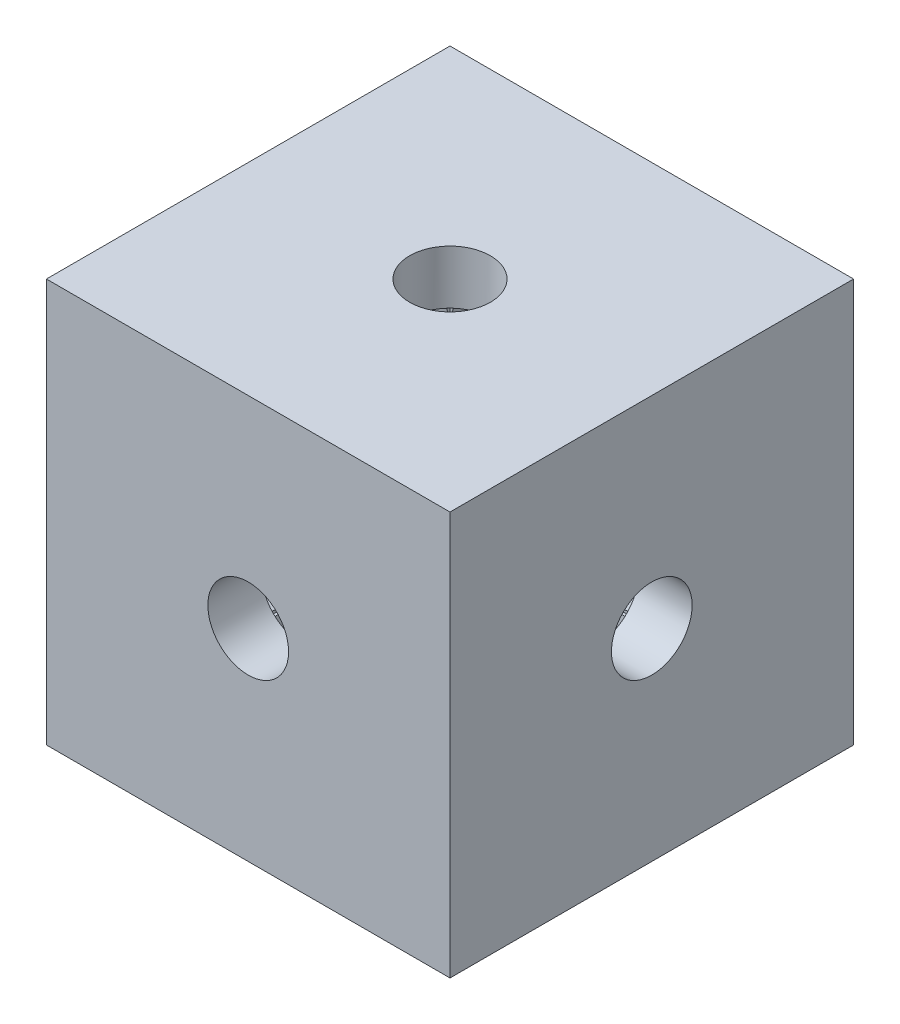
ISO-10303-21;
HEADER;
FILE_DESCRIPTION(('STEP AP214'),'2;1');
FILE_NAME('part.step','',(''),(''),'','','');
FILE_SCHEMA(('AUTOMOTIVE_DESIGN { 1 0 10303 214 1 1 1 1 }'));
ENDSEC;
DATA;
#1=APPLICATION_CONTEXT('core data for automotive mechanical design processes');
#2=APPLICATION_PROTOCOL_DEFINITION('international standard','automotive_design',2000,#1);
#3=PRODUCT_CONTEXT('',#1,'mechanical');
#4=PRODUCT('Part','Part','',(#3));
#5=PRODUCT_RELATED_PRODUCT_CATEGORY('part','',(#4));
#6=PRODUCT_DEFINITION_FORMATION('','',#4);
#7=PRODUCT_DEFINITION_CONTEXT('part definition',#1,'design');
#8=PRODUCT_DEFINITION('design','',#6,#7);
#9=PRODUCT_DEFINITION_SHAPE('','',#8);
#10=(LENGTH_UNIT() NAMED_UNIT(*) SI_UNIT(.MILLI.,.METRE.));
#11=(NAMED_UNIT(*) PLANE_ANGLE_UNIT() SI_UNIT($,.RADIAN.));
#12=(NAMED_UNIT(*) SI_UNIT($,.STERADIAN.) SOLID_ANGLE_UNIT());
#13=UNCERTAINTY_MEASURE_WITH_UNIT(LENGTH_MEASURE(1.E-05),#10,'distance_accuracy_value','');
#14=(GEOMETRIC_REPRESENTATION_CONTEXT(3) GLOBAL_UNCERTAINTY_ASSIGNED_CONTEXT((#13)) GLOBAL_UNIT_ASSIGNED_CONTEXT((#10,
#11,#12)) REPRESENTATION_CONTEXT('',''));
#15=CARTESIAN_POINT('',(0.,0.,0.));
#16=DIRECTION('',(0.,0.,1.));
#17=DIRECTION('',(1.,0.,0.));
#18=AXIS2_PLACEMENT_3D('',#15,#16,#17);
#19=CARTESIAN_POINT('',(7.5,13.,-5.49999999999998));
#20=DIRECTION('',(0.,0.,-1.));
#21=DIRECTION('',(-1.,0.,0.));
#22=AXIS2_PLACEMENT_3D('',#19,#20,#21);
#23=PLANE('',#22);
#24=DIRECTION('',(1.,0.,0.));
#25=VECTOR('',#24,1.);
#26=CARTESIAN_POINT('',(7.5,2.,-5.49999999999998));
#27=LINE('',#26,#25);
#28=CARTESIAN_POINT('',(0.,2.,-5.49999999999998));
#29=VERTEX_POINT('',#28);
#30=CARTESIAN_POINT('',(5.49999999999998,2.,-5.49999999999998));
#31=VERTEX_POINT('',#30);
#32=EDGE_CURVE('E283',#29,#31,#27,.T.);
#33=ORIENTED_EDGE('',*,*,#32,.T.);
#34=DIRECTION('',(0.,1.,0.));
#35=VECTOR('',#34,1.);
#36=CARTESIAN_POINT('',(5.49999999999998,2.,-5.49999999999998));
#37=LINE('',#36,#35);
#38=CARTESIAN_POINT('',(5.5,7.5,-5.49999999999998));
#39=VERTEX_POINT('',#38);
#40=EDGE_CURVE('E292',#31,#39,#37,.T.);
#41=ORIENTED_EDGE('',*,*,#40,.T.);
#42=CARTESIAN_POINT('',(0.,7.5,-5.49999999999998));
#43=DIRECTION('',(0.,0.,-1.));
#44=DIRECTION('',(-1.,0.,0.));
#45=AXIS2_PLACEMENT_3D('',#42,#43,#44);
#46=CIRCLE('',#45,5.5);
#47=EDGE_CURVE('E341',#29,#39,#46,.F.);
#48=ORIENTED_EDGE('',*,*,#47,.F.);
#49=EDGE_LOOP('',(#33,#41,#48));
#50=FACE_BOUND('',#49,.T.);
#51=ADVANCED_FACE('F176',(#50),#23,.F.);
#52=CARTESIAN_POINT('',(0.,2.,0.));
#53=DIRECTION('',(0.,-1.,0.));
#54=DIRECTION('',(0.,0.,-1.));
#55=AXIS2_PLACEMENT_3D('',#52,#53,#54);
#56=PLANE('',#55);
#57=DIRECTION('',(-1.,0.,0.));
#58=VECTOR('',#57,1.);
#59=CARTESIAN_POINT('',(7.5,2.,5.49999999999998));
#60=LINE('',#59,#58);
#61=CARTESIAN_POINT('',(5.49999999999998,2.,5.49999999999998));
#62=VERTEX_POINT('',#61);
#63=CARTESIAN_POINT('',(0.,2.,5.49999999999998));
#64=VERTEX_POINT('',#63);
#65=EDGE_CURVE('E282',#62,#64,#60,.T.);
#66=ORIENTED_EDGE('',*,*,#65,.F.);
#67=DIRECTION('',(0.,0.,-1.));
#68=VECTOR('',#67,1.);
#69=CARTESIAN_POINT('',(5.49999999999998,2.,5.49999999999998));
#70=LINE('',#69,#68);
#71=CARTESIAN_POINT('',(5.49999999999998,2.,0.));
#72=VERTEX_POINT('',#71);
#73=EDGE_CURVE('E293',#62,#72,#70,.T.);
#74=ORIENTED_EDGE('',*,*,#73,.T.);
#75=CARTESIAN_POINT('',(0.,2.,0.));
#76=DIRECTION('',(0.,-1.,0.));
#77=DIRECTION('',(0.,0.,-1.));
#78=AXIS2_PLACEMENT_3D('',#75,#76,#77);
#79=CIRCLE('',#78,5.49999999999998);
#80=EDGE_CURVE('E479',#64,#72,#79,.F.);
#81=ORIENTED_EDGE('',*,*,#80,.F.);
#82=EDGE_LOOP('',(#66,#74,#81));
#83=FACE_BOUND('',#82,.T.);
#84=ADVANCED_FACE('F425',(#83),#56,.F.);
#85=CARTESIAN_POINT('',(-5.49999999999998,13.,7.5));
#86=DIRECTION('',(-1.,0.,0.));
#87=DIRECTION('',(0.,0.,1.));
#88=AXIS2_PLACEMENT_3D('',#85,#86,#87);
#89=PLANE('',#88);
#90=DIRECTION('',(0.,-1.,0.));
#91=VECTOR('',#90,1.);
#92=CARTESIAN_POINT('',(-5.49999999999998,15.,-5.49999999999998));
#93=LINE('',#92,#91);
#94=CARTESIAN_POINT('',(-5.49999999999998,13.,-5.49999999999998));
#95=VERTEX_POINT('',#94);
#96=CARTESIAN_POINT('',(-5.49999999999999,7.5,-5.49999999999999));
#97=VERTEX_POINT('',#96);
#98=EDGE_CURVE('E350',#95,#97,#93,.T.);
#99=ORIENTED_EDGE('',*,*,#98,.F.);
#100=DIRECTION('',(0.,0.,1.));
#101=VECTOR('',#100,1.);
#102=CARTESIAN_POINT('',(-5.49999999999998,13.,-5.49999999999998));
#103=LINE('',#102,#101);
#104=CARTESIAN_POINT('',(-5.49999999999998,13.,0.));
#105=VERTEX_POINT('',#104);
#106=EDGE_CURVE('E300',#95,#105,#103,.T.);
#107=ORIENTED_EDGE('',*,*,#106,.T.);
#108=CARTESIAN_POINT('',(-5.49999999999998,7.5,0.));
#109=DIRECTION('',(-1.,0.,0.));
#110=DIRECTION('',(0.,0.,1.));
#111=AXIS2_PLACEMENT_3D('',#108,#109,#110);
#112=CIRCLE('',#111,5.49999999999998);
#113=EDGE_CURVE('E333',#97,#105,#112,.F.);
#114=ORIENTED_EDGE('',*,*,#113,.F.);
#115=EDGE_LOOP('',(#99,#107,#114));
#116=FACE_BOUND('',#115,.T.);
#117=ADVANCED_FACE('F432',(#116),#89,.F.);
#118=CARTESIAN_POINT('',(0.,13.,-5.49999999999998));
#119=VERTEX_POINT('',#118);
#120=EDGE_CURVE('E288',#39,#119,#46,.F.);
#121=ORIENTED_EDGE('',*,*,#120,.F.);
#122=CARTESIAN_POINT('',(5.49999999999998,13.,-5.49999999999998));
#123=VERTEX_POINT('',#122);
#124=EDGE_CURVE('E286',#39,#123,#37,.T.);
#125=ORIENTED_EDGE('',*,*,#124,.T.);
#126=DIRECTION('',(1.,0.,0.));
#127=VECTOR('',#126,1.);
#128=CARTESIAN_POINT('',(7.5,13.,-5.49999999999998));
#129=LINE('',#128,#127);
#130=EDGE_CURVE('E271',#119,#123,#129,.T.);
#131=ORIENTED_EDGE('',*,*,#130,.F.);
#132=EDGE_LOOP('',(#121,#125,#131));
#133=FACE_BOUND('',#132,.T.);
#134=ADVANCED_FACE('F287',(#133),#23,.F.);
#135=EDGE_CURVE('E352',#72,#29,#79,.F.);
#136=ORIENTED_EDGE('',*,*,#135,.F.);
#137=EDGE_CURVE('E191',#72,#31,#70,.T.);
#138=ORIENTED_EDGE('',*,*,#137,.T.);
#139=ORIENTED_EDGE('',*,*,#32,.F.);
#140=EDGE_LOOP('',(#136,#138,#139));
#141=FACE_BOUND('',#140,.T.);
#142=ADVANCED_FACE('F436',(#141),#56,.F.);
#143=DIRECTION('',(-1.,0.,0.));
#144=VECTOR('',#143,1.);
#145=CARTESIAN_POINT('',(-5.49999999999998,2.,5.49999999999998));
#146=LINE('',#145,#144);
#147=CARTESIAN_POINT('',(-5.49999999999998,2.,5.49999999999998));
#148=VERTEX_POINT('',#147);
#149=EDGE_CURVE('E313',#64,#148,#146,.T.);
#150=ORIENTED_EDGE('',*,*,#149,.F.);
#151=CARTESIAN_POINT('',(-5.49999999999998,2.,0.));
#152=VERTEX_POINT('',#151);
#153=EDGE_CURVE('E351',#152,#64,#79,.F.);
#154=ORIENTED_EDGE('',*,*,#153,.F.);
#155=DIRECTION('',(0.,0.,-1.));
#156=VECTOR('',#155,1.);
#157=CARTESIAN_POINT('',(-5.49999999999998,2.,7.5));
#158=LINE('',#157,#156);
#159=EDGE_CURVE('E376',#148,#152,#158,.T.);
#160=ORIENTED_EDGE('',*,*,#159,.F.);
#161=EDGE_LOOP('',(#150,#154,#160));
#162=FACE_BOUND('',#161,.T.);
#163=ADVANCED_FACE('F435',(#162),#56,.F.);
#164=DIRECTION('',(0.,1.,0.));
#165=VECTOR('',#164,1.);
#166=CARTESIAN_POINT('',(-5.49999999999998,2.,5.49999999999998));
#167=LINE('',#166,#165);
#168=CARTESIAN_POINT('',(-5.49999999999998,7.5,5.49999999999998));
#169=VERTEX_POINT('',#168);
#170=EDGE_CURVE('E317',#148,#169,#167,.T.);
#171=ORIENTED_EDGE('',*,*,#170,.F.);
#172=ORIENTED_EDGE('',*,*,#159,.T.);
#173=EDGE_CURVE('E338',#169,#152,#112,.F.);
#174=ORIENTED_EDGE('',*,*,#173,.F.);
#175=EDGE_LOOP('',(#171,#172,#174));
#176=FACE_BOUND('',#175,.T.);
#177=ADVANCED_FACE('F469',(#176),#89,.F.);
#178=EDGE_CURVE('E337',#105,#169,#112,.F.);
#179=ORIENTED_EDGE('',*,*,#178,.F.);
#180=CARTESIAN_POINT('',(-5.49999999999998,13.,5.49999999999998));
#181=VERTEX_POINT('',#180);
#182=EDGE_CURVE('E297',#105,#181,#103,.T.);
#183=ORIENTED_EDGE('',*,*,#182,.T.);
#184=DIRECTION('',(0.,-1.,0.));
#185=VECTOR('',#184,1.);
#186=CARTESIAN_POINT('',(-5.49999999999998,15.,5.49999999999998));
#187=LINE('',#186,#185);
#188=EDGE_CURVE('E356',#181,#169,#187,.T.);
#189=ORIENTED_EDGE('',*,*,#188,.T.);
#190=EDGE_LOOP('',(#179,#183,#189));
#191=FACE_BOUND('',#190,.T.);
#192=ADVANCED_FACE('F449',(#191),#89,.F.);
#193=DIRECTION('',(0.,0.,1.));
#194=VECTOR('',#193,1.);
#195=CARTESIAN_POINT('',(-5.49999999999998,2.,0.));
#196=LINE('',#195,#194);
#197=CARTESIAN_POINT('',(-5.49999999999998,2.,-5.49999999999998));
#198=VERTEX_POINT('',#197);
#199=EDGE_CURVE('E326',#198,#152,#196,.T.);
#200=ORIENTED_EDGE('',*,*,#199,.T.);
#201=EDGE_CURVE('E347',#29,#152,#79,.F.);
#202=ORIENTED_EDGE('',*,*,#201,.F.);
#203=DIRECTION('',(1.,0.,0.));
#204=VECTOR('',#203,1.);
#205=CARTESIAN_POINT('',(-7.5,2.,-5.49999999999998));
#206=LINE('',#205,#204);
#207=EDGE_CURVE('E370',#198,#29,#206,.T.);
#208=ORIENTED_EDGE('',*,*,#207,.F.);
#209=EDGE_LOOP('',(#200,#202,#208));
#210=FACE_BOUND('',#209,.T.);
#211=ADVANCED_FACE('F442',(#210),#56,.F.);
#212=DIRECTION('',(0.,-1.,0.));
#213=VECTOR('',#212,1.);
#214=CARTESIAN_POINT('',(-5.49999999999998,0.,-5.49999999999998));
#215=LINE('',#214,#213);
#216=EDGE_CURVE('E324',#97,#198,#215,.T.);
#217=ORIENTED_EDGE('',*,*,#216,.T.);
#218=ORIENTED_EDGE('',*,*,#207,.T.);
#219=EDGE_CURVE('E344',#97,#29,#46,.F.);
#220=ORIENTED_EDGE('',*,*,#219,.F.);
#221=EDGE_LOOP('',(#217,#218,#220));
#222=FACE_BOUND('',#221,.T.);
#223=ADVANCED_FACE('F428',(#222),#23,.F.);
#224=EDGE_CURVE('E486',#119,#97,#46,.F.);
#225=ORIENTED_EDGE('',*,*,#224,.F.);
#226=DIRECTION('',(-1.,0.,0.));
#227=VECTOR('',#226,1.);
#228=CARTESIAN_POINT('',(-5.49999999999998,13.,-5.49999999999998));
#229=LINE('',#228,#227);
#230=EDGE_CURVE('E278',#119,#95,#229,.T.);
#231=ORIENTED_EDGE('',*,*,#230,.T.);
#232=ORIENTED_EDGE('',*,*,#98,.T.);
#233=EDGE_LOOP('',(#225,#231,#232));
#234=FACE_BOUND('',#233,.T.);
#235=ADVANCED_FACE('F440',(#234),#23,.F.);
#236=CARTESIAN_POINT('',(0.,0.,0.));
#237=DIRECTION('',(0.,-1.,0.));
#238=DIRECTION('',(0.,0.,-1.));
#239=AXIS2_PLACEMENT_3D('',#236,#237,#238);
#240=PLANE('',#239);
#241=CARTESIAN_POINT('',(0.,0.,0.));
#242=DIRECTION('',(0.,-1.,0.));
#243=DIRECTION('',(0.,0.,-1.));
#244=AXIS2_PLACEMENT_3D('',#241,#242,#243);
#245=CIRCLE('',#244,5.49999999999998);
#246=CARTESIAN_POINT('',(0.,0.,-5.49999999999998));
#247=VERTEX_POINT('',#246);
#248=EDGE_CURVE('E343',#247,#247,#245,.T.);
#249=ORIENTED_EDGE('',*,*,#248,.F.);
#250=EDGE_LOOP('',(#249));
#251=FACE_BOUND('',#250,.T.);
#252=DIRECTION('',(0.,0.,-1.));
#253=VECTOR('',#252,1.);
#254=CARTESIAN_POINT('',(7.5,0.,7.5));
#255=LINE('',#254,#253);
#256=CARTESIAN_POINT('',(7.5,0.,7.5));
#257=VERTEX_POINT('',#256);
#258=CARTESIAN_POINT('',(7.5,0.,-7.5));
#259=VERTEX_POINT('',#258);
#260=EDGE_CURVE('E379',#257,#259,#255,.T.);
#261=ORIENTED_EDGE('',*,*,#260,.F.);
#262=DIRECTION('',(1.,0.,0.));
#263=VECTOR('',#262,1.);
#264=CARTESIAN_POINT('',(-7.5,0.,7.5));
#265=LINE('',#264,#263);
#266=CARTESIAN_POINT('',(-7.5,0.,7.5));
#267=VERTEX_POINT('',#266);
#268=EDGE_CURVE('E386',#267,#257,#265,.T.);
#269=ORIENTED_EDGE('',*,*,#268,.F.);
#270=DIRECTION('',(0.,0.,1.));
#271=VECTOR('',#270,1.);
#272=CARTESIAN_POINT('',(-7.5,0.,7.5));
#273=LINE('',#272,#271);
#274=CARTESIAN_POINT('',(-7.5,0.,-7.5));
#275=VERTEX_POINT('',#274);
#276=EDGE_CURVE('E384',#275,#267,#273,.T.);
#277=ORIENTED_EDGE('',*,*,#276,.F.);
#278=DIRECTION('',(-1.,0.,0.));
#279=VECTOR('',#278,1.);
#280=CARTESIAN_POINT('',(-7.5,0.,-7.5));
#281=LINE('',#280,#279);
#282=EDGE_CURVE('E382',#259,#275,#281,.T.);
#283=ORIENTED_EDGE('',*,*,#282,.F.);
#284=EDGE_LOOP('',(#261,#269,#277,#283));
#285=FACE_BOUND('',#284,.T.);
#286=ADVANCED_FACE('F403',(#251,#285),#240,.T.);
#287=CARTESIAN_POINT('',(7.5,2.,7.5));
#288=DIRECTION('',(-1.,0.,0.));
#289=DIRECTION('',(0.,0.,1.));
#290=AXIS2_PLACEMENT_3D('',#287,#288,#289);
#291=PLANE('',#290);
#292=ORIENTED_EDGE('',*,*,#260,.T.);
#293=DIRECTION('',(0.,-1.,0.));
#294=VECTOR('',#293,1.);
#295=CARTESIAN_POINT('',(7.5,2.,-7.5));
#296=LINE('',#295,#294);
#297=CARTESIAN_POINT('',(7.5,15.,-7.5));
#298=VERTEX_POINT('',#297);
#299=EDGE_CURVE('E12',#298,#259,#296,.T.);
#300=ORIENTED_EDGE('',*,*,#299,.F.);
#301=DIRECTION('',(0.,0.,-1.));
#302=VECTOR('',#301,1.);
#303=CARTESIAN_POINT('',(7.5,15.,-7.5));
#304=LINE('',#303,#302);
#305=CARTESIAN_POINT('',(7.5,15.,7.5));
#306=VERTEX_POINT('',#305);
#307=EDGE_CURVE('E361',#306,#298,#304,.T.);
#308=ORIENTED_EDGE('',*,*,#307,.F.);
#309=DIRECTION('',(0.,-1.,0.));
#310=VECTOR('',#309,1.);
#311=CARTESIAN_POINT('',(7.5,2.,7.5));
#312=LINE('',#311,#310);
#313=EDGE_CURVE('E388',#306,#257,#312,.T.);
#314=ORIENTED_EDGE('',*,*,#313,.T.);
#315=EDGE_LOOP('',(#292,#300,#308,#314));
#316=FACE_BOUND('',#315,.T.);
#317=CARTESIAN_POINT('',(7.5,7.5,0.));
#318=DIRECTION('',(1.,0.,0.));
#319=DIRECTION('',(0.,0.,-1.));
#320=AXIS2_PLACEMENT_3D('',#317,#318,#319);
#321=CIRCLE('',#320,1.5);
#322=CARTESIAN_POINT('',(7.5,7.5,-1.5));
#323=VERTEX_POINT('',#322);
#324=EDGE_CURVE('E968',#323,#323,#321,.T.);
#325=ORIENTED_EDGE('',*,*,#324,.F.);
#326=EDGE_LOOP('',(#325));
#327=FACE_BOUND('',#326,.T.);
#328=ADVANCED_FACE('F178',(#316,#327),#291,.F.);
#329=CARTESIAN_POINT('',(-7.5,2.,-7.5));
#330=DIRECTION('',(0.,0.,1.));
#331=DIRECTION('',(1.,0.,0.));
#332=AXIS2_PLACEMENT_3D('',#329,#330,#331);
#333=PLANE('',#332);
#334=CARTESIAN_POINT('',(0.,7.5,-7.5));
#335=DIRECTION('',(0.,0.,-1.));
#336=DIRECTION('',(-1.,0.,0.));
#337=AXIS2_PLACEMENT_3D('',#334,#335,#336);
#338=CIRCLE('',#337,5.5);
#339=CARTESIAN_POINT('',(-5.5,7.5,-7.5));
#340=VERTEX_POINT('',#339);
#341=EDGE_CURVE('E336',#340,#340,#338,.T.);
#342=ORIENTED_EDGE('',*,*,#341,.F.);
#343=EDGE_LOOP('',(#342));
#344=FACE_BOUND('',#343,.T.);
#345=ORIENTED_EDGE('',*,*,#282,.T.);
#346=DIRECTION('',(0.,-1.,0.));
#347=VECTOR('',#346,1.);
#348=CARTESIAN_POINT('',(-7.5,2.,-7.5));
#349=LINE('',#348,#347);
#350=CARTESIAN_POINT('',(-7.5,15.,-7.5));
#351=VERTEX_POINT('',#350);
#352=EDGE_CURVE('E184',#351,#275,#349,.T.);
#353=ORIENTED_EDGE('',*,*,#352,.F.);
#354=DIRECTION('',(-1.,0.,0.));
#355=VECTOR('',#354,1.);
#356=CARTESIAN_POINT('',(-7.5,15.,-7.5));
#357=LINE('',#356,#355);
#358=EDGE_CURVE('E364',#298,#351,#357,.T.);
#359=ORIENTED_EDGE('',*,*,#358,.F.);
#360=ORIENTED_EDGE('',*,*,#299,.T.);
#361=EDGE_LOOP('',(#345,#353,#359,#360));
#362=FACE_BOUND('',#361,.T.);
#363=ADVANCED_FACE('F414',(#344,#362),#333,.F.);
#364=CARTESIAN_POINT('',(-7.5,2.,7.5));
#365=DIRECTION('',(1.,0.,0.));
#366=DIRECTION('',(0.,0.,-1.));
#367=AXIS2_PLACEMENT_3D('',#364,#365,#366);
#368=PLANE('',#367);
#369=CARTESIAN_POINT('',(-7.5,7.5,0.));
#370=DIRECTION('',(-1.,0.,0.));
#371=DIRECTION('',(0.,0.,1.));
#372=AXIS2_PLACEMENT_3D('',#369,#370,#371);
#373=CIRCLE('',#372,5.49999999999998);
#374=CARTESIAN_POINT('',(-7.5,7.5,5.49999999999998));
#375=VERTEX_POINT('',#374);
#376=EDGE_CURVE('E330',#375,#375,#373,.T.);
#377=ORIENTED_EDGE('',*,*,#376,.F.);
#378=EDGE_LOOP('',(#377));
#379=FACE_BOUND('',#378,.T.);
#380=DIRECTION('',(0.,-1.,0.));
#381=VECTOR('',#380,1.);
#382=CARTESIAN_POINT('',(-7.5,2.,7.5));
#383=LINE('',#382,#381);
#384=CARTESIAN_POINT('',(-7.5,15.,7.5));
#385=VERTEX_POINT('',#384);
#386=EDGE_CURVE('E391',#385,#267,#383,.T.);
#387=ORIENTED_EDGE('',*,*,#386,.F.);
#388=DIRECTION('',(0.,0.,1.));
#389=VECTOR('',#388,1.);
#390=CARTESIAN_POINT('',(-7.5,15.,7.5));
#391=LINE('',#390,#389);
#392=EDGE_CURVE('E367',#351,#385,#391,.T.);
#393=ORIENTED_EDGE('',*,*,#392,.F.);
#394=ORIENTED_EDGE('',*,*,#352,.T.);
#395=ORIENTED_EDGE('',*,*,#276,.T.);
#396=EDGE_LOOP('',(#387,#393,#394,#395));
#397=FACE_BOUND('',#396,.T.);
#398=ADVANCED_FACE('F397',(#379,#397),#368,.F.);
#399=CARTESIAN_POINT('',(-7.5,2.,7.5));
#400=DIRECTION('',(0.,0.,-1.));
#401=DIRECTION('',(-1.,0.,0.));
#402=AXIS2_PLACEMENT_3D('',#399,#400,#401);
#403=PLANE('',#402);
#404=ORIENTED_EDGE('',*,*,#268,.T.);
#405=ORIENTED_EDGE('',*,*,#313,.F.);
#406=DIRECTION('',(1.,0.,0.));
#407=VECTOR('',#406,1.);
#408=CARTESIAN_POINT('',(7.5,15.,7.5));
#409=LINE('',#408,#407);
#410=EDGE_CURVE('E358',#385,#306,#409,.T.);
#411=ORIENTED_EDGE('',*,*,#410,.F.);
#412=ORIENTED_EDGE('',*,*,#386,.T.);
#413=EDGE_LOOP('',(#404,#405,#411,#412));
#414=FACE_BOUND('',#413,.T.);
#415=CARTESIAN_POINT('',(0.,7.5,7.5));
#416=DIRECTION('',(0.,0.,1.));
#417=DIRECTION('',(1.,0.,0.));
#418=AXIS2_PLACEMENT_3D('',#415,#416,#417);
#419=CIRCLE('',#418,1.5);
#420=CARTESIAN_POINT('',(1.5,7.5,7.5));
#421=VERTEX_POINT('',#420);
#422=EDGE_CURVE('E309',#421,#421,#419,.T.);
#423=ORIENTED_EDGE('',*,*,#422,.F.);
#424=EDGE_LOOP('',(#423));
#425=FACE_BOUND('',#424,.T.);
#426=ADVANCED_FACE('F405',(#414,#425),#403,.F.);
#427=CARTESIAN_POINT('',(7.5,13.,5.49999999999998));
#428=DIRECTION('',(0.,0.,1.));
#429=DIRECTION('',(1.,0.,0.));
#430=AXIS2_PLACEMENT_3D('',#427,#428,#429);
#431=PLANE('',#430);
#432=DIRECTION('',(-1.,0.,0.));
#433=VECTOR('',#432,1.);
#434=CARTESIAN_POINT('',(7.5,13.,5.49999999999998));
#435=LINE('',#434,#433);
#436=CARTESIAN_POINT('',(5.49999999999998,13.,5.49999999999998));
#437=VERTEX_POINT('',#436);
#438=EDGE_CURVE('E374',#437,#181,#435,.T.);
#439=ORIENTED_EDGE('',*,*,#438,.F.);
#440=DIRECTION('',(0.,-1.,0.));
#441=VECTOR('',#440,1.);
#442=CARTESIAN_POINT('',(5.49999999999998,2.,5.49999999999998));
#443=LINE('',#442,#441);
#444=EDGE_CURVE('E199',#437,#62,#443,.T.);
#445=ORIENTED_EDGE('',*,*,#444,.T.);
#446=ORIENTED_EDGE('',*,*,#65,.T.);
#447=ORIENTED_EDGE('',*,*,#149,.T.);
#448=ORIENTED_EDGE('',*,*,#170,.T.);
#449=ORIENTED_EDGE('',*,*,#188,.F.);
#450=EDGE_LOOP('',(#439,#445,#446,#447,#448,#449));
#451=FACE_BOUND('',#450,.T.);
#452=CARTESIAN_POINT('',(0.,7.5,5.49999999999998));
#453=DIRECTION('',(0.,0.,1.));
#454=DIRECTION('',(1.,0.,0.));
#455=AXIS2_PLACEMENT_3D('',#452,#453,#454);
#456=CIRCLE('',#455,1.5);
#457=CARTESIAN_POINT('',(1.5,7.5,5.49999999999998));
#458=VERTEX_POINT('',#457);
#459=EDGE_CURVE('E316',#458,#458,#456,.F.);
#460=ORIENTED_EDGE('',*,*,#459,.F.);
#461=EDGE_LOOP('',(#460));
#462=FACE_BOUND('',#461,.T.);
#463=ADVANCED_FACE('F472',(#451,#462),#431,.F.);
#464=CARTESIAN_POINT('',(0.,13.,0.));
#465=DIRECTION('',(0.,-1.,0.));
#466=DIRECTION('',(0.,0.,-1.));
#467=AXIS2_PLACEMENT_3D('',#464,#465,#466);
#468=PLANE('',#467);
#469=DIRECTION('',(0.,0.,1.));
#470=VECTOR('',#469,1.);
#471=CARTESIAN_POINT('',(5.49999999999998,13.,5.49999999999998));
#472=LINE('',#471,#470);
#473=EDGE_CURVE('E276',#123,#437,#472,.T.);
#474=ORIENTED_EDGE('',*,*,#473,.T.);
#475=ORIENTED_EDGE('',*,*,#438,.T.);
#476=ORIENTED_EDGE('',*,*,#182,.F.);
#477=ORIENTED_EDGE('',*,*,#106,.F.);
#478=ORIENTED_EDGE('',*,*,#230,.F.);
#479=ORIENTED_EDGE('',*,*,#130,.T.);
#480=EDGE_LOOP('',(#474,#475,#476,#477,#478,#479));
#481=FACE_BOUND('',#480,.T.);
#482=CARTESIAN_POINT('',(0.,13.,0.));
#483=DIRECTION('',(0.,-1.,0.));
#484=DIRECTION('',(0.,0.,-1.));
#485=AXIS2_PLACEMENT_3D('',#482,#483,#484);
#486=CIRCLE('',#485,1.5);
#487=CARTESIAN_POINT('',(0.,13.,-1.5));
#488=VERTEX_POINT('',#487);
#489=EDGE_CURVE('E307',#488,#488,#486,.F.);
#490=ORIENTED_EDGE('',*,*,#489,.T.);
#491=EDGE_LOOP('',(#490));
#492=FACE_BOUND('',#491,.T.);
#493=ADVANCED_FACE('F273',(#481,#492),#468,.T.);
#494=CARTESIAN_POINT('',(0.,15.,0.));
#495=DIRECTION('',(0.,-1.,0.));
#496=DIRECTION('',(0.,0.,-1.));
#497=AXIS2_PLACEMENT_3D('',#494,#495,#496);
#498=PLANE('',#497);
#499=ORIENTED_EDGE('',*,*,#410,.T.);
#500=ORIENTED_EDGE('',*,*,#307,.T.);
#501=ORIENTED_EDGE('',*,*,#358,.T.);
#502=ORIENTED_EDGE('',*,*,#392,.T.);
#503=EDGE_LOOP('',(#499,#500,#501,#502));
#504=FACE_BOUND('',#503,.T.);
#505=CARTESIAN_POINT('',(0.,15.,0.));
#506=DIRECTION('',(0.,1.,0.));
#507=DIRECTION('',(0.,0.,1.));
#508=AXIS2_PLACEMENT_3D('',#505,#506,#507);
#509=CIRCLE('',#508,1.5);
#510=CARTESIAN_POINT('',(0.,15.,1.5));
#511=VERTEX_POINT('',#510);
#512=EDGE_CURVE('E304',#511,#511,#509,.T.);
#513=ORIENTED_EDGE('',*,*,#512,.F.);
#514=EDGE_LOOP('',(#513));
#515=FACE_BOUND('',#514,.T.);
#516=ADVANCED_FACE('F412',(#504,#515),#498,.F.);
#517=CARTESIAN_POINT('',(0.,9.778174593052,0.));
#518=DIRECTION('',(0.,-1.,0.));
#519=DIRECTION('',(0.,0.,-1.));
#520=AXIS2_PLACEMENT_3D('',#517,#518,#519);
#521=CYLINDRICAL_SURFACE('',#520,5.49999999999998);
#522=ORIENTED_EDGE('',*,*,#248,.T.);
#523=EDGE_LOOP('',(#522));
#524=FACE_BOUND('',#523,.T.);
#525=ORIENTED_EDGE('',*,*,#201,.T.);
#526=ORIENTED_EDGE('',*,*,#153,.T.);
#527=ORIENTED_EDGE('',*,*,#80,.T.);
#528=ORIENTED_EDGE('',*,*,#135,.T.);
#529=EDGE_LOOP('',(#525,#526,#527,#528));
#530=FACE_BOUND('',#529,.T.);
#531=ADVANCED_FACE('F481',(#524,#530),#521,.F.);
#532=CARTESIAN_POINT('',(0.,7.5,2.27817459305203));
#533=DIRECTION('',(0.,0.,-1.));
#534=DIRECTION('',(-1.,0.,0.));
#535=AXIS2_PLACEMENT_3D('',#532,#533,#534);
#536=CYLINDRICAL_SURFACE('',#535,5.5);
#537=ORIENTED_EDGE('',*,*,#341,.T.);
#538=EDGE_LOOP('',(#537));
#539=FACE_BOUND('',#538,.T.);
#540=ORIENTED_EDGE('',*,*,#47,.T.);
#541=ORIENTED_EDGE('',*,*,#120,.T.);
#542=ORIENTED_EDGE('',*,*,#224,.T.);
#543=ORIENTED_EDGE('',*,*,#219,.T.);
#544=EDGE_LOOP('',(#540,#541,#542,#543));
#545=FACE_BOUND('',#544,.T.);
#546=ADVANCED_FACE('F484',(#539,#545),#536,.F.);
#547=CARTESIAN_POINT('',(2.27817459305203,7.5,0.));
#548=DIRECTION('',(-1.,0.,0.));
#549=DIRECTION('',(0.,0.,1.));
#550=AXIS2_PLACEMENT_3D('',#547,#548,#549);
#551=CYLINDRICAL_SURFACE('',#550,5.49999999999998);
#552=ORIENTED_EDGE('',*,*,#376,.T.);
#553=EDGE_LOOP('',(#552));
#554=FACE_BOUND('',#553,.T.);
#555=ORIENTED_EDGE('',*,*,#113,.T.);
#556=ORIENTED_EDGE('',*,*,#178,.T.);
#557=ORIENTED_EDGE('',*,*,#173,.T.);
#558=CARTESIAN_POINT('',(-5.49999999999998,7.5,0.));
#559=DIRECTION('',(-1.,0.,0.));
#560=DIRECTION('',(0.,0.,1.));
#561=AXIS2_PLACEMENT_3D('',#558,#559,#560);
#562=CIRCLE('',#561,5.49999999999998);
#563=EDGE_CURVE('E327',#152,#97,#562,.F.);
#564=ORIENTED_EDGE('',*,*,#563,.T.);
#565=EDGE_LOOP('',(#555,#556,#557,#564));
#566=FACE_BOUND('',#565,.T.);
#567=ADVANCED_FACE('F464',(#554,#566),#551,.F.);
#568=CARTESIAN_POINT('',(-5.49999999999998,13.,7.5));
#569=DIRECTION('',(-1.,0.,0.));
#570=DIRECTION('',(0.,0.,1.));
#571=AXIS2_PLACEMENT_3D('',#568,#569,#570);
#572=PLANE('',#571);
#573=ORIENTED_EDGE('',*,*,#199,.F.);
#574=ORIENTED_EDGE('',*,*,#216,.F.);
#575=ORIENTED_EDGE('',*,*,#563,.F.);
#576=EDGE_LOOP('',(#573,#574,#575));
#577=FACE_BOUND('',#576,.T.);
#578=ADVANCED_FACE('F461',(#577),#572,.F.);
#579=CARTESIAN_POINT('',(0.,7.5,-10.056349186104));
#580=DIRECTION('',(0.,0.,1.));
#581=DIRECTION('',(1.,0.,0.));
#582=AXIS2_PLACEMENT_3D('',#579,#580,#581);
#583=CYLINDRICAL_SURFACE('',#582,1.5);
#584=ORIENTED_EDGE('',*,*,#459,.T.);
#585=EDGE_LOOP('',(#584));
#586=FACE_BOUND('',#585,.T.);
#587=ORIENTED_EDGE('',*,*,#422,.T.);
#588=EDGE_LOOP('',(#587));
#589=FACE_BOUND('',#588,.T.);
#590=ADVANCED_FACE('F539',(#586,#589),#583,.F.);
#591=CARTESIAN_POINT('',(0.,-2.55634918610399,0.));
#592=DIRECTION('',(0.,1.,0.));
#593=DIRECTION('',(0.,0.,1.));
#594=AXIS2_PLACEMENT_3D('',#591,#592,#593);
#595=CYLINDRICAL_SURFACE('',#594,1.5);
#596=ORIENTED_EDGE('',*,*,#512,.T.);
#597=EDGE_LOOP('',(#596));
#598=FACE_BOUND('',#597,.T.);
#599=ORIENTED_EDGE('',*,*,#489,.F.);
#600=EDGE_LOOP('',(#599));
#601=FACE_BOUND('',#600,.T.);
#602=ADVANCED_FACE('F543',(#598,#601),#595,.F.);
#603=CARTESIAN_POINT('',(5.49999999999998,0.,0.));
#604=DIRECTION('',(-1.,0.,0.));
#605=DIRECTION('',(0.,0.,1.));
#606=AXIS2_PLACEMENT_3D('',#603,#604,#605);
#607=PLANE('',#606);
#608=CARTESIAN_POINT('',(5.49999999999998,7.5,0.));
#609=DIRECTION('',(1.,0.,0.));
#610=DIRECTION('',(0.,0.,-1.));
#611=AXIS2_PLACEMENT_3D('',#608,#609,#610);
#612=CIRCLE('',#611,1.5);
#613=CARTESIAN_POINT('',(5.49999999999998,7.5,-1.5));
#614=VERTEX_POINT('',#613);
#615=EDGE_CURVE('E965',#614,#614,#612,.T.);
#616=ORIENTED_EDGE('',*,*,#615,.T.);
#617=EDGE_LOOP('',(#616));
#618=FACE_BOUND('',#617,.T.);
#619=ORIENTED_EDGE('',*,*,#444,.F.);
#620=ORIENTED_EDGE('',*,*,#473,.F.);
#621=ORIENTED_EDGE('',*,*,#124,.F.);
#622=ORIENTED_EDGE('',*,*,#40,.F.);
#623=ORIENTED_EDGE('',*,*,#137,.F.);
#624=ORIENTED_EDGE('',*,*,#73,.F.);
#625=EDGE_LOOP('',(#619,#620,#621,#622,#623,#624));
#626=FACE_BOUND('',#625,.T.);
#627=ADVANCED_FACE('F295',(#618,#626),#607,.T.);
#628=CARTESIAN_POINT('',(5.49999999999998,7.5,0.));
#629=DIRECTION('',(1.,0.,0.));
#630=DIRECTION('',(0.,0.,-1.));
#631=AXIS2_PLACEMENT_3D('',#628,#629,#630);
#632=CYLINDRICAL_SURFACE('',#631,1.5);
#633=ORIENTED_EDGE('',*,*,#615,.F.);
#634=EDGE_LOOP('',(#633));
#635=FACE_BOUND('',#634,.T.);
#636=ORIENTED_EDGE('',*,*,#324,.T.);
#637=EDGE_LOOP('',(#636));
#638=FACE_BOUND('',#637,.T.);
#639=ADVANCED_FACE('F565',(#635,#638),#632,.F.);
#640=CLOSED_SHELL('',(#51,#84,#117,#134,#142,#163,#177,#192,#211,#223,#235,#286,#328,#363,#398,
#426,#463,#493,#516,#531,#546,#567,#578,#590,#602,#627,#639));
#641=MANIFOLD_SOLID_BREP('B2',#640);
#642=ADVANCED_BREP_SHAPE_REPRESENTATION('',(#18,#641),#14);
#643=SHAPE_DEFINITION_REPRESENTATION(#9,#642);
ENDSEC;
END-ISO-10303-21;
